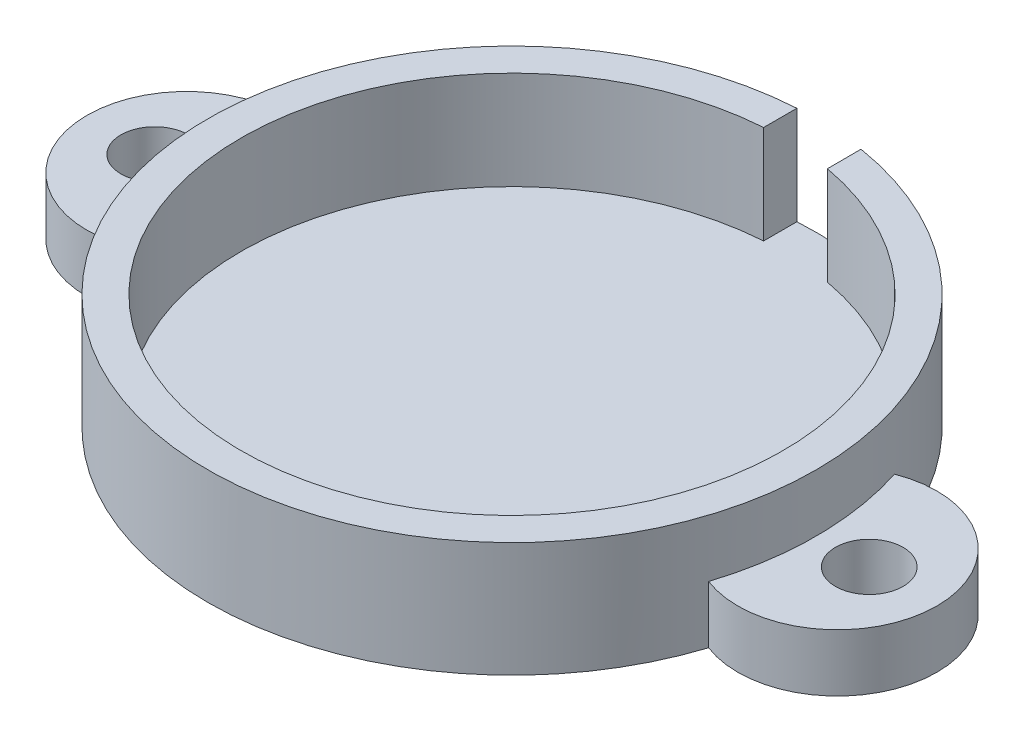
ISO-10303-21;
HEADER;
FILE_DESCRIPTION(('STEP AP214'),'2;1');
FILE_NAME('part.step','',(''),(''),'','','');
FILE_SCHEMA(('AUTOMOTIVE_DESIGN { 1 0 10303 214 1 1 1 1 }'));
ENDSEC;
DATA;
#1=APPLICATION_CONTEXT('core data for automotive mechanical design processes');
#2=APPLICATION_PROTOCOL_DEFINITION('international standard','automotive_design',2000,#1);
#3=PRODUCT_CONTEXT('',#1,'mechanical');
#4=PRODUCT('Part','Part','',(#3));
#5=PRODUCT_RELATED_PRODUCT_CATEGORY('part','',(#4));
#6=PRODUCT_DEFINITION_FORMATION('','',#4);
#7=PRODUCT_DEFINITION_CONTEXT('part definition',#1,'design');
#8=PRODUCT_DEFINITION('design','',#6,#7);
#9=PRODUCT_DEFINITION_SHAPE('','',#8);
#10=(LENGTH_UNIT() NAMED_UNIT(*) SI_UNIT(.MILLI.,.METRE.));
#11=(NAMED_UNIT(*) PLANE_ANGLE_UNIT() SI_UNIT($,.RADIAN.));
#12=(NAMED_UNIT(*) SI_UNIT($,.STERADIAN.) SOLID_ANGLE_UNIT());
#13=UNCERTAINTY_MEASURE_WITH_UNIT(LENGTH_MEASURE(1.E-05),#10,'distance_accuracy_value','');
#14=(GEOMETRIC_REPRESENTATION_CONTEXT(3) GLOBAL_UNCERTAINTY_ASSIGNED_CONTEXT((#13)) GLOBAL_UNIT_ASSIGNED_CONTEXT((#10,
#11,#12)) REPRESENTATION_CONTEXT('',''));
#15=CARTESIAN_POINT('',(0.,0.,0.));
#16=DIRECTION('',(0.,0.,1.));
#17=DIRECTION('',(1.,0.,0.));
#18=AXIS2_PLACEMENT_3D('',#15,#16,#17);
#19=CARTESIAN_POINT('',(0.,21.971,0.));
#20=DIRECTION('',(0.,-1.,0.));
#21=DIRECTION('',(0.,0.,-1.));
#22=AXIS2_PLACEMENT_3D('',#19,#20,#21);
#23=CYLINDRICAL_SURFACE('',#22,58.166);
#24=CARTESIAN_POINT('',(0.,0.,0.));
#25=DIRECTION('',(0.,1.,0.));
#26=DIRECTION('',(0.,0.,1.));
#27=AXIS2_PLACEMENT_3D('',#24,#25,#26);
#28=CIRCLE('',#27,58.166);
#29=CARTESIAN_POINT('',(55.3828857142857,0.,-17.7769380366352));
#30=VERTEX_POINT('',#29);
#31=CARTESIAN_POINT('',(-55.3828857142857,0.,-17.7769380366352));
#32=VERTEX_POINT('',#31);
#33=EDGE_CURVE('E42',#30,#32,#28,.T.);
#34=ORIENTED_EDGE('',*,*,#33,.T.);
#35=DIRECTION('',(0.,-1.,0.));
#36=VECTOR('',#35,1.);
#37=CARTESIAN_POINT('',(-55.3828857142857,10.9855,-17.7769380366352));
#38=LINE('',#37,#36);
#39=CARTESIAN_POINT('',(-55.3828857142857,10.9855,-17.7769380366352));
#40=VERTEX_POINT('',#39);
#41=EDGE_CURVE('E59',#40,#32,#38,.T.);
#42=ORIENTED_EDGE('',*,*,#41,.F.);
#43=CARTESIAN_POINT('',(0.,10.9855,0.));
#44=DIRECTION('',(0.,1.,0.));
#45=DIRECTION('',(0.,0.,1.));
#46=AXIS2_PLACEMENT_3D('',#43,#44,#45);
#47=CIRCLE('',#46,58.166);
#48=CARTESIAN_POINT('',(-55.3828857142857,10.9855,17.7769380366352));
#49=VERTEX_POINT('',#48);
#50=EDGE_CURVE('E54',#40,#49,#47,.T.);
#51=ORIENTED_EDGE('',*,*,#50,.T.);
#52=DIRECTION('',(0.,-1.,0.));
#53=VECTOR('',#52,1.);
#54=CARTESIAN_POINT('',(-55.3828857142857,10.9855,17.7769380366352));
#55=LINE('',#54,#53);
#56=CARTESIAN_POINT('',(-55.3828857142857,0.,17.7769380366352));
#57=VERTEX_POINT('',#56);
#58=EDGE_CURVE('E113',#49,#57,#55,.T.);
#59=ORIENTED_EDGE('',*,*,#58,.T.);
#60=CARTESIAN_POINT('',(55.3828857142857,0.,17.7769380366352));
#61=VERTEX_POINT('',#60);
#62=EDGE_CURVE('E103',#57,#61,#28,.T.);
#63=ORIENTED_EDGE('',*,*,#62,.T.);
#64=DIRECTION('',(0.,-1.,0.));
#65=VECTOR('',#64,1.);
#66=CARTESIAN_POINT('',(55.3828857142857,10.9855,17.7769380366352));
#67=LINE('',#66,#65);
#68=CARTESIAN_POINT('',(55.3828857142857,10.9855,17.7769380366352));
#69=VERTEX_POINT('',#68);
#70=EDGE_CURVE('E153',#69,#61,#67,.T.);
#71=ORIENTED_EDGE('',*,*,#70,.F.);
#72=CARTESIAN_POINT('',(0.,10.9855,0.));
#73=DIRECTION('',(0.,1.,0.));
#74=DIRECTION('',(0.,0.,1.));
#75=AXIS2_PLACEMENT_3D('',#72,#73,#74);
#76=CIRCLE('',#75,58.166);
#77=CARTESIAN_POINT('',(55.3828857142857,10.9855,-17.7769380366352));
#78=VERTEX_POINT('',#77);
#79=EDGE_CURVE('E143',#69,#78,#76,.T.);
#80=ORIENTED_EDGE('',*,*,#79,.T.);
#81=DIRECTION('',(0.,-1.,0.));
#82=VECTOR('',#81,1.);
#83=CARTESIAN_POINT('',(55.3828857142857,10.9855,-17.7769380366352));
#84=LINE('',#83,#82);
#85=EDGE_CURVE('E150',#78,#30,#84,.T.);
#86=ORIENTED_EDGE('',*,*,#85,.T.);
#87=EDGE_LOOP('',(#34,#42,#51,#59,#63,#71,#80,#86));
#88=FACE_BOUND('',#87,.T.);
#89=CARTESIAN_POINT('',(0.,3.175,0.));
#90=DIRECTION('',(0.,1.,0.));
#91=DIRECTION('',(0.,0.,1.));
#92=AXIS2_PLACEMENT_3D('',#89,#90,#91);
#93=CIRCLE('',#92,58.166);
#94=CARTESIAN_POINT('',(9.34075689132414,3.175,-57.4110948919909));
#95=VERTEX_POINT('',#94);
#96=CARTESIAN_POINT('',(-3.57037670971178,3.175,-58.0563171941758));
#97=VERTEX_POINT('',#96);
#98=EDGE_CURVE('E160',#95,#97,#93,.T.);
#99=ORIENTED_EDGE('',*,*,#98,.F.);
#100=DIRECTION('',(0.,1.,0.));
#101=VECTOR('',#100,1.);
#102=CARTESIAN_POINT('',(9.34075689132414,3.175,-57.4110948919909));
#103=LINE('',#102,#101);
#104=CARTESIAN_POINT('',(9.34075689132414,21.971,-57.4110948919909));
#105=VERTEX_POINT('',#104);
#106=EDGE_CURVE('E177',#95,#105,#103,.T.);
#107=ORIENTED_EDGE('',*,*,#106,.T.);
#108=CARTESIAN_POINT('',(0.,21.971,0.));
#109=DIRECTION('',(0.,1.,0.));
#110=DIRECTION('',(0.,0.,1.));
#111=AXIS2_PLACEMENT_3D('',#108,#109,#110);
#112=CIRCLE('',#111,58.166);
#113=CARTESIAN_POINT('',(-3.57037670971178,21.971,-58.0563171941758));
#114=VERTEX_POINT('',#113);
#115=EDGE_CURVE('E11',#114,#105,#112,.T.);
#116=ORIENTED_EDGE('',*,*,#115,.F.);
#117=DIRECTION('',(0.,1.,0.));
#118=VECTOR('',#117,1.);
#119=CARTESIAN_POINT('',(-3.57037670971178,3.175,-58.0563171941758));
#120=LINE('',#119,#118);
#121=EDGE_CURVE('E172',#97,#114,#120,.T.);
#122=ORIENTED_EDGE('',*,*,#121,.F.);
#123=EDGE_LOOP('',(#99,#107,#116,#122));
#124=FACE_BOUND('',#123,.T.);
#125=ADVANCED_FACE('F39',(#88,#124),#23,.T.);
#126=CARTESIAN_POINT('',(0.,21.971,0.));
#127=DIRECTION('',(0.,1.,0.));
#128=DIRECTION('',(0.,0.,1.));
#129=AXIS2_PLACEMENT_3D('',#126,#127,#128);
#130=PLANE('',#129);
#131=DIRECTION('',(-0.00345713476909509,0.,-0.999994024091738));
#132=VECTOR('',#131,1.);
#133=CARTESIAN_POINT('',(9.36304882857231,21.971,-50.9630373175871));
#134=LINE('',#133,#132);
#135=CARTESIAN_POINT('',(9.36304882857231,21.971,-50.9630373175871));
#136=VERTEX_POINT('',#135);
#137=EDGE_CURVE('E165',#136,#105,#134,.T.);
#138=ORIENTED_EDGE('',*,*,#137,.F.);
#139=CARTESIAN_POINT('',(0.,21.971,0.));
#140=DIRECTION('',(0.,1.,0.));
#141=DIRECTION('',(0.,0.,1.));
#142=AXIS2_PLACEMENT_3D('',#139,#140,#141);
#143=CIRCLE('',#142,51.816);
#144=CARTESIAN_POINT('',(-3.57037670971178,21.971,-51.6928454058272));
#145=VERTEX_POINT('',#144);
#146=EDGE_CURVE('E181',#145,#136,#143,.T.);
#147=ORIENTED_EDGE('',*,*,#146,.F.);
#148=DIRECTION('',(0.,0.,1.));
#149=VECTOR('',#148,1.);
#150=CARTESIAN_POINT('',(-3.57037670971178,21.971,-51.6928454058272));
#151=LINE('',#150,#149);
#152=EDGE_CURVE('E156',#114,#145,#151,.T.);
#153=ORIENTED_EDGE('',*,*,#152,.F.);
#154=ORIENTED_EDGE('',*,*,#115,.T.);
#155=EDGE_LOOP('',(#138,#147,#153,#154));
#156=FACE_BOUND('',#155,.T.);
#157=ADVANCED_FACE('F205',(#156),#130,.T.);
#158=CARTESIAN_POINT('',(0.,0.,0.));
#159=DIRECTION('',(0.,1.,0.));
#160=DIRECTION('',(0.,0.,1.));
#161=AXIS2_PLACEMENT_3D('',#158,#159,#160);
#162=PLANE('',#161);
#163=ORIENTED_EDGE('',*,*,#33,.F.);
#164=CARTESIAN_POINT('',(62.23,0.,0.));
#165=DIRECTION('',(0.,-1.,0.));
#166=DIRECTION('',(0.,0.,-1.));
#167=AXIS2_PLACEMENT_3D('',#164,#165,#166);
#168=CIRCLE('',#167,19.05);
#169=EDGE_CURVE('E109',#30,#61,#168,.T.);
#170=ORIENTED_EDGE('',*,*,#169,.T.);
#171=ORIENTED_EDGE('',*,*,#62,.F.);
#172=CARTESIAN_POINT('',(-62.23,0.,0.));
#173=DIRECTION('',(0.,-1.,0.));
#174=DIRECTION('',(0.,0.,-1.));
#175=AXIS2_PLACEMENT_3D('',#172,#173,#174);
#176=CIRCLE('',#175,19.05);
#177=EDGE_CURVE('E107',#57,#32,#176,.T.);
#178=ORIENTED_EDGE('',*,*,#177,.T.);
#179=EDGE_LOOP('',(#163,#170,#171,#178));
#180=FACE_BOUND('',#179,.T.);
#181=CARTESIAN_POINT('',(68.326,0.,0.));
#182=DIRECTION('',(0.,-1.,0.));
#183=DIRECTION('',(0.,0.,-1.));
#184=AXIS2_PLACEMENT_3D('',#181,#182,#183);
#185=CIRCLE('',#184,6.477);
#186=CARTESIAN_POINT('',(68.326,0.,-6.477));
#187=VERTEX_POINT('',#186);
#188=EDGE_CURVE('E134',#187,#187,#185,.T.);
#189=ORIENTED_EDGE('',*,*,#188,.F.);
#190=EDGE_LOOP('',(#189));
#191=FACE_BOUND('',#190,.T.);
#192=CARTESIAN_POINT('',(-68.3238241724542,0.,0.));
#193=DIRECTION('',(0.,-1.,0.));
#194=DIRECTION('',(0.,0.,-1.));
#195=AXIS2_PLACEMENT_3D('',#192,#193,#194);
#196=CIRCLE('',#195,6.477);
#197=CARTESIAN_POINT('',(-68.3238241724542,0.,-6.477));
#198=VERTEX_POINT('',#197);
#199=EDGE_CURVE('E129',#198,#198,#196,.T.);
#200=ORIENTED_EDGE('',*,*,#199,.F.);
#201=EDGE_LOOP('',(#200));
#202=FACE_BOUND('',#201,.T.);
#203=ADVANCED_FACE('F104',(#180,#191,#202),#162,.F.);
#204=CARTESIAN_POINT('',(0.,3.175,0.));
#205=DIRECTION('',(0.,1.,0.));
#206=DIRECTION('',(0.,0.,1.));
#207=AXIS2_PLACEMENT_3D('',#204,#205,#206);
#208=CYLINDRICAL_SURFACE('',#207,51.816);
#209=ORIENTED_EDGE('',*,*,#146,.T.);
#210=DIRECTION('',(0.,1.,0.));
#211=VECTOR('',#210,1.);
#212=CARTESIAN_POINT('',(9.36304882857231,3.175,-50.9630373175871));
#213=LINE('',#212,#211);
#214=CARTESIAN_POINT('',(9.36304882857231,3.175,-50.9630373175871));
#215=VERTEX_POINT('',#214);
#216=EDGE_CURVE('E182',#215,#136,#213,.T.);
#217=ORIENTED_EDGE('',*,*,#216,.F.);
#218=CARTESIAN_POINT('',(0.,3.175,0.));
#219=DIRECTION('',(0.,1.,0.));
#220=DIRECTION('',(0.,0.,1.));
#221=AXIS2_PLACEMENT_3D('',#218,#219,#220);
#222=CIRCLE('',#221,51.816);
#223=CARTESIAN_POINT('',(-3.57037670971178,3.175,-51.6928454058272));
#224=VERTEX_POINT('',#223);
#225=EDGE_CURVE('E112',#224,#215,#222,.T.);
#226=ORIENTED_EDGE('',*,*,#225,.F.);
#227=DIRECTION('',(0.,1.,0.));
#228=VECTOR('',#227,1.);
#229=CARTESIAN_POINT('',(-3.57037670971178,3.175,-51.6928454058272));
#230=LINE('',#229,#228);
#231=EDGE_CURVE('E185',#224,#145,#230,.T.);
#232=ORIENTED_EDGE('',*,*,#231,.T.);
#233=EDGE_LOOP('',(#209,#217,#226,#232));
#234=FACE_BOUND('',#233,.T.);
#235=ADVANCED_FACE('F199',(#234),#208,.F.);
#236=CARTESIAN_POINT('',(0.,3.175,0.));
#237=DIRECTION('',(0.,1.,0.));
#238=DIRECTION('',(0.,0.,1.));
#239=AXIS2_PLACEMENT_3D('',#236,#237,#238);
#240=PLANE('',#239);
#241=ORIENTED_EDGE('',*,*,#225,.T.);
#242=DIRECTION('',(-0.00345713476909509,0.,-0.999994024091738));
#243=VECTOR('',#242,1.);
#244=CARTESIAN_POINT('',(9.36304882857231,3.175,-50.9630373175871));
#245=LINE('',#244,#243);
#246=EDGE_CURVE('E168',#215,#95,#245,.T.);
#247=ORIENTED_EDGE('',*,*,#246,.T.);
#248=ORIENTED_EDGE('',*,*,#98,.T.);
#249=DIRECTION('',(0.,0.,1.));
#250=VECTOR('',#249,1.);
#251=CARTESIAN_POINT('',(-3.57037670971178,3.175,-51.6928454058272));
#252=LINE('',#251,#250);
#253=EDGE_CURVE('E164',#97,#224,#252,.T.);
#254=ORIENTED_EDGE('',*,*,#253,.T.);
#255=EDGE_LOOP('',(#241,#247,#248,#254));
#256=FACE_BOUND('',#255,.T.);
#257=ADVANCED_FACE('F212',(#256),#240,.T.);
#258=CARTESIAN_POINT('',(9.36304882857231,3.175,-50.9630373175871));
#259=DIRECTION('',(0.999994024091739,0.,-0.00345713476909509));
#260=DIRECTION('',(-0.00345713476909509,0.,-0.999994024091739));
#261=AXIS2_PLACEMENT_3D('',#258,#259,#260);
#262=PLANE('',#261);
#263=ORIENTED_EDGE('',*,*,#137,.T.);
#264=ORIENTED_EDGE('',*,*,#106,.F.);
#265=ORIENTED_EDGE('',*,*,#246,.F.);
#266=ORIENTED_EDGE('',*,*,#216,.T.);
#267=EDGE_LOOP('',(#263,#264,#265,#266));
#268=FACE_BOUND('',#267,.T.);
#269=ADVANCED_FACE('F208',(#268),#262,.F.);
#270=CARTESIAN_POINT('',(-3.57037670971178,3.175,-51.6928454058272));
#271=DIRECTION('',(-1.,0.,0.));
#272=DIRECTION('',(0.,0.,1.));
#273=AXIS2_PLACEMENT_3D('',#270,#271,#272);
#274=PLANE('',#273);
#275=ORIENTED_EDGE('',*,*,#152,.T.);
#276=ORIENTED_EDGE('',*,*,#231,.F.);
#277=ORIENTED_EDGE('',*,*,#253,.F.);
#278=ORIENTED_EDGE('',*,*,#121,.T.);
#279=EDGE_LOOP('',(#275,#276,#277,#278));
#280=FACE_BOUND('',#279,.T.);
#281=ADVANCED_FACE('F214',(#280),#274,.F.);
#282=CARTESIAN_POINT('',(62.23,10.9855,0.));
#283=DIRECTION('',(0.,-1.,0.));
#284=DIRECTION('',(0.,0.,-1.));
#285=AXIS2_PLACEMENT_3D('',#282,#283,#284);
#286=CYLINDRICAL_SURFACE('',#285,19.05);
#287=ORIENTED_EDGE('',*,*,#169,.F.);
#288=ORIENTED_EDGE('',*,*,#85,.F.);
#289=CARTESIAN_POINT('',(62.23,10.9855,0.));
#290=DIRECTION('',(0.,-1.,0.));
#291=DIRECTION('',(0.,0.,-1.));
#292=AXIS2_PLACEMENT_3D('',#289,#290,#291);
#293=CIRCLE('',#292,19.05);
#294=EDGE_CURVE('E146',#78,#69,#293,.T.);
#295=ORIENTED_EDGE('',*,*,#294,.T.);
#296=ORIENTED_EDGE('',*,*,#70,.T.);
#297=EDGE_LOOP('',(#287,#288,#295,#296));
#298=FACE_BOUND('',#297,.T.);
#299=ADVANCED_FACE('F216',(#298),#286,.T.);
#300=CARTESIAN_POINT('',(31.115,10.9855,0.));
#301=DIRECTION('',(0.,1.,0.));
#302=DIRECTION('',(0.,0.,1.));
#303=AXIS2_PLACEMENT_3D('',#300,#301,#302);
#304=PLANE('',#303);
#305=CARTESIAN_POINT('',(68.326,10.9855,0.));
#306=DIRECTION('',(0.,-1.,0.));
#307=DIRECTION('',(0.,0.,-1.));
#308=AXIS2_PLACEMENT_3D('',#305,#306,#307);
#309=CIRCLE('',#308,6.477);
#310=CARTESIAN_POINT('',(68.326,10.9855,-6.477));
#311=VERTEX_POINT('',#310);
#312=EDGE_CURVE('E136',#311,#311,#309,.T.);
#313=ORIENTED_EDGE('',*,*,#312,.T.);
#314=EDGE_LOOP('',(#313));
#315=FACE_BOUND('',#314,.T.);
#316=ORIENTED_EDGE('',*,*,#79,.F.);
#317=ORIENTED_EDGE('',*,*,#294,.F.);
#318=EDGE_LOOP('',(#316,#317));
#319=FACE_BOUND('',#318,.T.);
#320=ADVANCED_FACE('F222',(#315,#319),#304,.T.);
#321=CARTESIAN_POINT('',(68.326,10.9855,0.));
#322=DIRECTION('',(0.,-1.,0.));
#323=DIRECTION('',(0.,0.,-1.));
#324=AXIS2_PLACEMENT_3D('',#321,#322,#323);
#325=CYLINDRICAL_SURFACE('',#324,6.477);
#326=ORIENTED_EDGE('',*,*,#312,.F.);
#327=EDGE_LOOP('',(#326));
#328=FACE_BOUND('',#327,.T.);
#329=ORIENTED_EDGE('',*,*,#188,.T.);
#330=EDGE_LOOP('',(#329));
#331=FACE_BOUND('',#330,.T.);
#332=ADVANCED_FACE('F278',(#328,#331),#325,.F.);
#333=CARTESIAN_POINT('',(-62.23,10.9855,0.));
#334=DIRECTION('',(0.,-1.,0.));
#335=DIRECTION('',(0.,0.,-1.));
#336=AXIS2_PLACEMENT_3D('',#333,#334,#335);
#337=CYLINDRICAL_SURFACE('',#336,19.05);
#338=ORIENTED_EDGE('',*,*,#177,.F.);
#339=ORIENTED_EDGE('',*,*,#58,.F.);
#340=CARTESIAN_POINT('',(-62.23,10.9855,0.));
#341=DIRECTION('',(0.,-1.,0.));
#342=DIRECTION('',(0.,0.,-1.));
#343=AXIS2_PLACEMENT_3D('',#340,#341,#342);
#344=CIRCLE('',#343,19.05);
#345=EDGE_CURVE('E119',#49,#40,#344,.T.);
#346=ORIENTED_EDGE('',*,*,#345,.T.);
#347=ORIENTED_EDGE('',*,*,#41,.T.);
#348=EDGE_LOOP('',(#338,#339,#346,#347));
#349=FACE_BOUND('',#348,.T.);
#350=ADVANCED_FACE('F121',(#349),#337,.T.);
#351=CARTESIAN_POINT('',(-31.115,10.9855,0.));
#352=DIRECTION('',(0.,1.,0.));
#353=DIRECTION('',(0.,0.,1.));
#354=AXIS2_PLACEMENT_3D('',#351,#352,#353);
#355=PLANE('',#354);
#356=CARTESIAN_POINT('',(-68.3238241724542,10.9855,0.));
#357=DIRECTION('',(0.,-1.,0.));
#358=DIRECTION('',(0.,0.,-1.));
#359=AXIS2_PLACEMENT_3D('',#356,#357,#358);
#360=CIRCLE('',#359,6.477);
#361=CARTESIAN_POINT('',(-68.3238241724542,10.9855,-6.477));
#362=VERTEX_POINT('',#361);
#363=EDGE_CURVE('E123',#362,#362,#360,.T.);
#364=ORIENTED_EDGE('',*,*,#363,.T.);
#365=EDGE_LOOP('',(#364));
#366=FACE_BOUND('',#365,.T.);
#367=ORIENTED_EDGE('',*,*,#50,.F.);
#368=ORIENTED_EDGE('',*,*,#345,.F.);
#369=EDGE_LOOP('',(#367,#368));
#370=FACE_BOUND('',#369,.T.);
#371=ADVANCED_FACE('F297',(#366,#370),#355,.T.);
#372=CARTESIAN_POINT('',(-68.3238241724542,10.9855,0.));
#373=DIRECTION('',(0.,-1.,0.));
#374=DIRECTION('',(0.,0.,-1.));
#375=AXIS2_PLACEMENT_3D('',#372,#373,#374);
#376=CYLINDRICAL_SURFACE('',#375,6.477);
#377=ORIENTED_EDGE('',*,*,#363,.F.);
#378=EDGE_LOOP('',(#377));
#379=FACE_BOUND('',#378,.T.);
#380=ORIENTED_EDGE('',*,*,#199,.T.);
#381=EDGE_LOOP('',(#380));
#382=FACE_BOUND('',#381,.T.);
#383=ADVANCED_FACE('F307',(#379,#382),#376,.F.);
#384=CLOSED_SHELL('',(#125,#157,#203,#235,#257,#269,#281,#299,#320,#332,#350,#371,#383));
#385=MANIFOLD_SOLID_BREP('B2',#384);
#386=ADVANCED_BREP_SHAPE_REPRESENTATION('',(#18,#385),#14);
#387=SHAPE_DEFINITION_REPRESENTATION(#9,#386);
ENDSEC;
END-ISO-10303-21;
